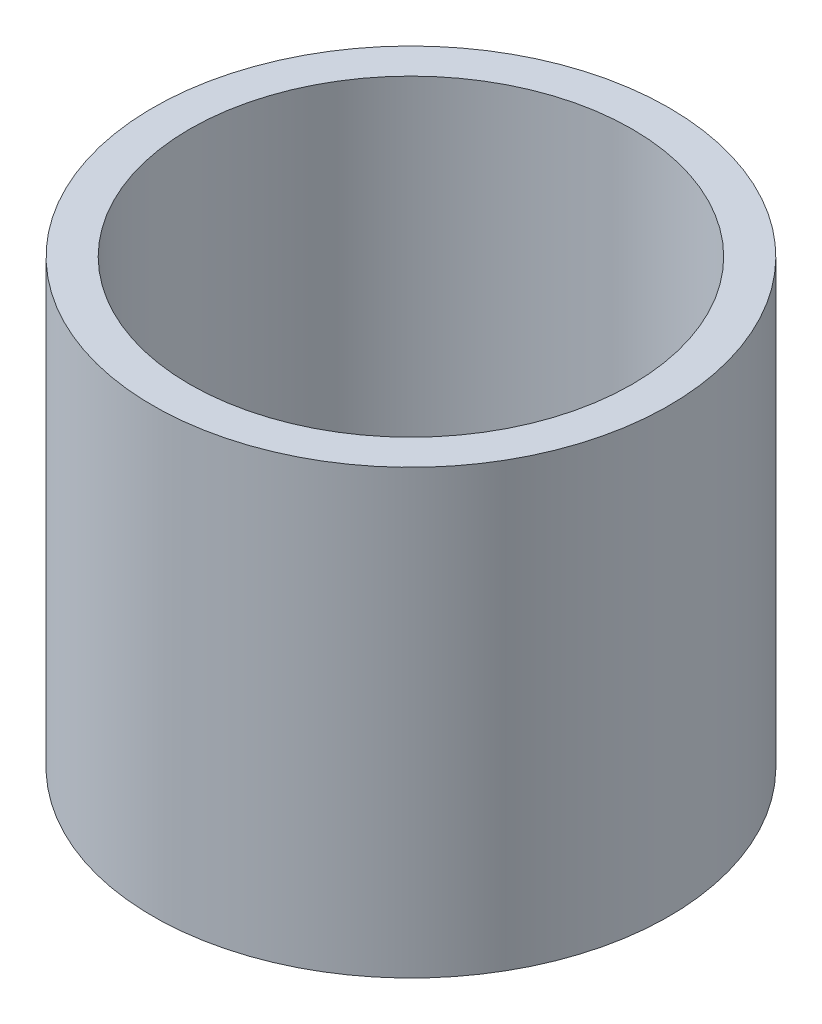
ISO-10303-21;
HEADER;
FILE_DESCRIPTION(('STEP AP214'),'2;1');
FILE_NAME('part.step','',(''),(''),'','','');
FILE_SCHEMA(('AUTOMOTIVE_DESIGN { 1 0 10303 214 1 1 1 1 }'));
ENDSEC;
DATA;
#1=APPLICATION_CONTEXT('core data for automotive mechanical design processes');
#2=APPLICATION_PROTOCOL_DEFINITION('international standard','automotive_design',2000,#1);
#3=PRODUCT_CONTEXT('',#1,'mechanical');
#4=PRODUCT('Part','Part','',(#3));
#5=PRODUCT_RELATED_PRODUCT_CATEGORY('part','',(#4));
#6=PRODUCT_DEFINITION_FORMATION('','',#4);
#7=PRODUCT_DEFINITION_CONTEXT('part definition',#1,'design');
#8=PRODUCT_DEFINITION('design','',#6,#7);
#9=PRODUCT_DEFINITION_SHAPE('','',#8);
#10=(LENGTH_UNIT() NAMED_UNIT(*) SI_UNIT(.MILLI.,.METRE.));
#11=(NAMED_UNIT(*) PLANE_ANGLE_UNIT() SI_UNIT($,.RADIAN.));
#12=(NAMED_UNIT(*) SI_UNIT($,.STERADIAN.) SOLID_ANGLE_UNIT());
#13=UNCERTAINTY_MEASURE_WITH_UNIT(LENGTH_MEASURE(1.E-05),#10,'distance_accuracy_value','');
#14=(GEOMETRIC_REPRESENTATION_CONTEXT(3) GLOBAL_UNCERTAINTY_ASSIGNED_CONTEXT((#13)) GLOBAL_UNIT_ASSIGNED_CONTEXT((#10,
#11,#12)) REPRESENTATION_CONTEXT('',''));
#15=CARTESIAN_POINT('',(0.,0.,0.));
#16=DIRECTION('',(0.,0.,1.));
#17=DIRECTION('',(1.,0.,0.));
#18=AXIS2_PLACEMENT_3D('',#15,#16,#17);
#19=CARTESIAN_POINT('',(-11.980856658486,19.05,0.));
#20=DIRECTION('',(0.,-1.,0.));
#21=DIRECTION('',(0.,0.,-1.));
#22=AXIS2_PLACEMENT_3D('',#19,#20,#21);
#23=CYLINDRICAL_SURFACE('',#22,19.05);
#24=CARTESIAN_POINT('',(-11.980856658486,0.,0.));
#25=DIRECTION('',(0.,-1.,0.));
#26=DIRECTION('',(0.,0.,-1.));
#27=AXIS2_PLACEMENT_3D('',#24,#25,#26);
#28=CIRCLE('',#27,19.05);
#29=CARTESIAN_POINT('',(-11.980856658486,0.,-19.05));
#30=VERTEX_POINT('',#29);
#31=EDGE_CURVE('E18',#30,#30,#28,.F.);
#32=ORIENTED_EDGE('',*,*,#31,.F.);
#33=EDGE_LOOP('',(#32));
#34=FACE_BOUND('',#33,.T.);
#35=CARTESIAN_POINT('',(-11.980856658486,38.1,0.));
#36=DIRECTION('',(0.,-1.,0.));
#37=DIRECTION('',(0.,0.,-1.));
#38=AXIS2_PLACEMENT_3D('',#35,#36,#37);
#39=CIRCLE('',#38,19.05);
#40=CARTESIAN_POINT('',(-11.980856658486,38.1,-19.05));
#41=VERTEX_POINT('',#40);
#42=EDGE_CURVE('E27',#41,#41,#39,.T.);
#43=ORIENTED_EDGE('',*,*,#42,.F.);
#44=EDGE_LOOP('',(#43));
#45=FACE_BOUND('',#44,.T.);
#46=ADVANCED_FACE('F15',(#34,#45),#23,.F.);
#47=CARTESIAN_POINT('',(8.65664334151397,0.,0.));
#48=DIRECTION('',(0.,-1.,0.));
#49=DIRECTION('',(0.,0.,-1.));
#50=AXIS2_PLACEMENT_3D('',#47,#48,#49);
#51=PLANE('',#50);
#52=ORIENTED_EDGE('',*,*,#31,.T.);
#53=EDGE_LOOP('',(#52));
#54=FACE_BOUND('',#53,.T.);
#55=CARTESIAN_POINT('',(-11.980856658486,0.,0.));
#56=DIRECTION('',(0.,-1.,0.));
#57=DIRECTION('',(0.,0.,-1.));
#58=AXIS2_PLACEMENT_3D('',#55,#56,#57);
#59=CIRCLE('',#58,22.225);
#60=CARTESIAN_POINT('',(-11.980856658486,0.,-22.225));
#61=VERTEX_POINT('',#60);
#62=EDGE_CURVE('E22',#61,#61,#59,.F.);
#63=ORIENTED_EDGE('',*,*,#62,.F.);
#64=EDGE_LOOP('',(#63));
#65=FACE_BOUND('',#64,.T.);
#66=ADVANCED_FACE('F35',(#54,#65),#51,.T.);
#67=CARTESIAN_POINT('',(8.65664334151397,38.1,0.));
#68=DIRECTION('',(0.,1.,0.));
#69=DIRECTION('',(0.,0.,1.));
#70=AXIS2_PLACEMENT_3D('',#67,#68,#69);
#71=PLANE('',#70);
#72=ORIENTED_EDGE('',*,*,#42,.T.);
#73=EDGE_LOOP('',(#72));
#74=FACE_BOUND('',#73,.T.);
#75=CARTESIAN_POINT('',(-11.980856658486,38.1,0.));
#76=DIRECTION('',(0.,-1.,0.));
#77=DIRECTION('',(0.,0.,-1.));
#78=AXIS2_PLACEMENT_3D('',#75,#76,#77);
#79=CIRCLE('',#78,22.225);
#80=CARTESIAN_POINT('',(-11.980856658486,38.1,-22.225));
#81=VERTEX_POINT('',#80);
#82=EDGE_CURVE('E10',#81,#81,#79,.T.);
#83=ORIENTED_EDGE('',*,*,#82,.F.);
#84=EDGE_LOOP('',(#83));
#85=FACE_BOUND('',#84,.T.);
#86=ADVANCED_FACE('F44',(#74,#85),#71,.T.);
#87=CARTESIAN_POINT('',(-11.980856658486,19.05,0.));
#88=DIRECTION('',(0.,-1.,0.));
#89=DIRECTION('',(0.,0.,-1.));
#90=AXIS2_PLACEMENT_3D('',#87,#88,#89);
#91=CYLINDRICAL_SURFACE('',#90,22.225);
#92=ORIENTED_EDGE('',*,*,#82,.T.);
#93=EDGE_LOOP('',(#92));
#94=FACE_BOUND('',#93,.T.);
#95=ORIENTED_EDGE('',*,*,#62,.T.);
#96=EDGE_LOOP('',(#95));
#97=FACE_BOUND('',#96,.T.);
#98=ADVANCED_FACE('F45',(#94,#97),#91,.T.);
#99=CLOSED_SHELL('',(#46,#66,#86,#98));
#100=MANIFOLD_SOLID_BREP('B1',#99);
#101=ADVANCED_BREP_SHAPE_REPRESENTATION('',(#18,#100),#14);
#102=SHAPE_DEFINITION_REPRESENTATION(#9,#101);
ENDSEC;
END-ISO-10303-21;
